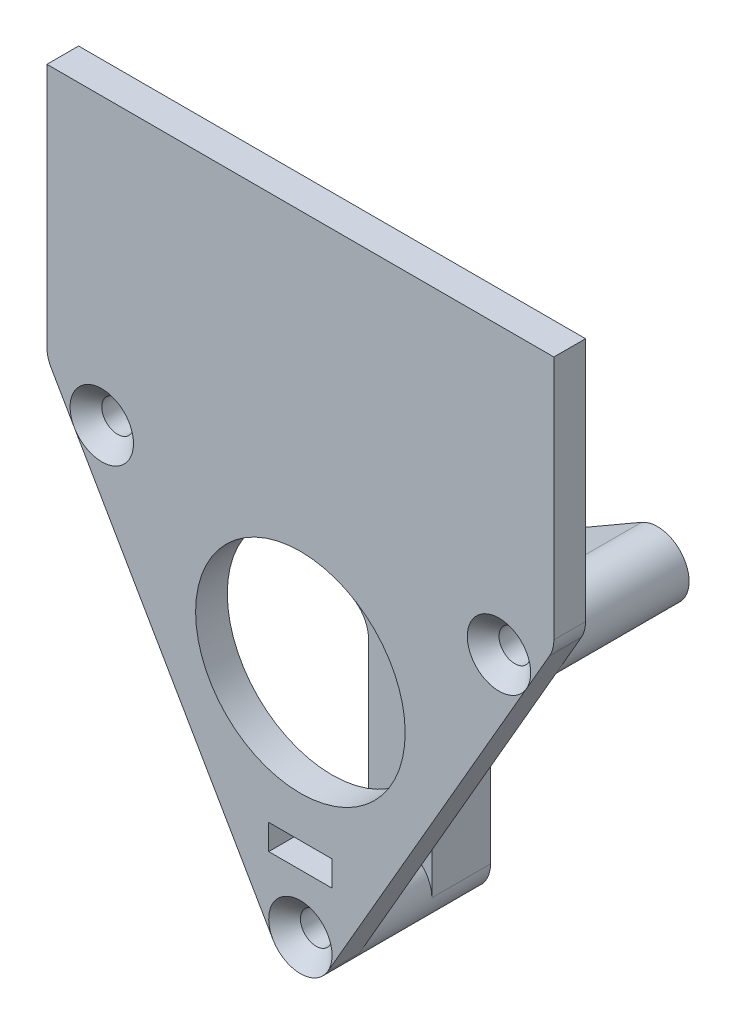
ISO-10303-21;
HEADER;
FILE_DESCRIPTION(('STEP AP214'),'2;1');
FILE_NAME('part.step','',(''),(''),'','','');
FILE_SCHEMA(('AUTOMOTIVE_DESIGN { 1 0 10303 214 1 1 1 1 }'));
ENDSEC;
DATA;
#1=APPLICATION_CONTEXT('core data for automotive mechanical design processes');
#2=APPLICATION_PROTOCOL_DEFINITION('international standard','automotive_design',2000,#1);
#3=PRODUCT_CONTEXT('',#1,'mechanical');
#4=PRODUCT('Part','Part','',(#3));
#5=PRODUCT_RELATED_PRODUCT_CATEGORY('part','',(#4));
#6=PRODUCT_DEFINITION_FORMATION('','',#4);
#7=PRODUCT_DEFINITION_CONTEXT('part definition',#1,'design');
#8=PRODUCT_DEFINITION('design','',#6,#7);
#9=PRODUCT_DEFINITION_SHAPE('','',#8);
#10=(LENGTH_UNIT() NAMED_UNIT(*) SI_UNIT(.MILLI.,.METRE.));
#11=(NAMED_UNIT(*) PLANE_ANGLE_UNIT() SI_UNIT($,.RADIAN.));
#12=(NAMED_UNIT(*) SI_UNIT($,.STERADIAN.) SOLID_ANGLE_UNIT());
#13=UNCERTAINTY_MEASURE_WITH_UNIT(LENGTH_MEASURE(1.E-05),#10,'distance_accuracy_value','');
#14=(GEOMETRIC_REPRESENTATION_CONTEXT(3) GLOBAL_UNCERTAINTY_ASSIGNED_CONTEXT((#13)) GLOBAL_UNIT_ASSIGNED_CONTEXT((#10,
#11,#12)) REPRESENTATION_CONTEXT('',''));
#15=CARTESIAN_POINT('',(0.,0.,0.));
#16=DIRECTION('',(0.,0.,1.));
#17=DIRECTION('',(1.,0.,0.));
#18=AXIS2_PLACEMENT_3D('',#15,#16,#17);
#19=CARTESIAN_POINT('',(-6.35,0.,50.8562346175287));
#20=DIRECTION('',(-1.,0.,0.));
#21=DIRECTION('',(0.,-1.,0.));
#22=AXIS2_PLACEMENT_3D('',#19,#20,#21);
#23=PLANE('',#22);
#24=DIRECTION('',(0.,-1.,0.));
#25=VECTOR('',#24,1.);
#26=CARTESIAN_POINT('',(-6.35,0.,-16.825));
#27=LINE('',#26,#25);
#28=CARTESIAN_POINT('',(-6.35,-7.33234841870833,-16.825));
#29=VERTEX_POINT('',#28);
#30=CARTESIAN_POINT('',(-6.35,-45.958787349666,-16.825));
#31=VERTEX_POINT('',#30);
#32=EDGE_CURVE('E257',#29,#31,#27,.T.);
#33=ORIENTED_EDGE('',*,*,#32,.F.);
#34=DIRECTION('',(0.,0.,-1.));
#35=VECTOR('',#34,1.);
#36=CARTESIAN_POINT('',(-6.35,-7.33234841870833,50.8562346175287));
#37=LINE('',#36,#35);
#38=CARTESIAN_POINT('',(-6.35,-7.33234841870833,-28.575));
#39=VERTEX_POINT('',#38);
#40=EDGE_CURVE('E406',#29,#39,#37,.T.);
#41=ORIENTED_EDGE('',*,*,#40,.T.);
#42=DIRECTION('',(0.,1.,0.));
#43=VECTOR('',#42,1.);
#44=CARTESIAN_POINT('',(-6.35,0.,-28.575));
#45=LINE('',#44,#43);
#46=CARTESIAN_POINT('',(-6.35,-45.958787349666,-28.575));
#47=VERTEX_POINT('',#46);
#48=EDGE_CURVE('E249',#47,#39,#45,.T.);
#49=ORIENTED_EDGE('',*,*,#48,.F.);
#50=DIRECTION('',(0.,0.,-1.));
#51=VECTOR('',#50,1.);
#52=CARTESIAN_POINT('',(-6.35,-45.958787349666,50.8562346175287));
#53=LINE('',#52,#51);
#54=EDGE_CURVE('E262',#31,#47,#53,.T.);
#55=ORIENTED_EDGE('',*,*,#54,.F.);
#56=EDGE_LOOP('',(#33,#41,#49,#55));
#57=FACE_BOUND('',#56,.T.);
#58=ADVANCED_FACE('F41',(#57),#23,.T.);
#59=CARTESIAN_POINT('',(-39.8014773719378,22.9793936748326,-28.575));
#60=DIRECTION('',(0.,0.,1.));
#61=DIRECTION('',(1.,0.,0.));
#62=AXIS2_PLACEMENT_3D('',#59,#60,#61);
#63=CYLINDRICAL_SURFACE('',#62,6.35);
#64=CARTESIAN_POINT('',(-39.8014773719378,22.9793936748326,-3.175));
#65=DIRECTION('',(0.,0.,-1.));
#66=DIRECTION('',(0.499999999999992,0.866025403784443,0.));
#67=AXIS2_PLACEMENT_3D('',#64,#65,#66);
#68=CIRCLE('',#67,6.35);
#69=CARTESIAN_POINT('',(-45.3007386859687,19.8043936748328,-3.175));
#70=VERTEX_POINT('',#69);
#71=EDGE_CURVE('E238',#70,#70,#68,.T.);
#72=ORIENTED_EDGE('',*,*,#71,.T.);
#73=EDGE_LOOP('',(#72));
#74=FACE_BOUND('',#73,.T.);
#75=DIRECTION('',(0.,0.,-1.));
#76=VECTOR('',#75,1.);
#77=CARTESIAN_POINT('',(-36.6264773719379,28.4786549888638,60.4851880986184));
#78=LINE('',#77,#76);
#79=CARTESIAN_POINT('',(-36.6264773719379,28.4786549888638,-16.825));
#80=VERTEX_POINT('',#79);
#81=CARTESIAN_POINT('',(-36.6264773719379,28.4786549888638,-28.575));
#82=VERTEX_POINT('',#81);
#83=EDGE_CURVE('E217',#80,#82,#78,.T.);
#84=ORIENTED_EDGE('',*,*,#83,.T.);
#85=CARTESIAN_POINT('',(-39.8014773719378,22.9793936748326,-28.575));
#86=DIRECTION('',(0.,0.,-1.));
#87=DIRECTION('',(0.499999999999992,0.866025403784443,0.));
#88=AXIS2_PLACEMENT_3D('',#85,#86,#87);
#89=CIRCLE('',#88,6.35);
#90=CARTESIAN_POINT('',(-42.9764773719378,17.4801323608014,-28.575));
#91=VERTEX_POINT('',#90);
#92=EDGE_CURVE('E229',#91,#82,#89,.T.);
#93=ORIENTED_EDGE('',*,*,#92,.F.);
#94=DIRECTION('',(0.,0.,-1.));
#95=VECTOR('',#94,1.);
#96=CARTESIAN_POINT('',(-42.9764773719378,17.4801323608014,60.4851880986184));
#97=LINE('',#96,#95);
#98=CARTESIAN_POINT('',(-42.9764773719378,17.4801323608014,-16.825));
#99=VERTEX_POINT('',#98);
#100=EDGE_CURVE('E232',#99,#91,#97,.T.);
#101=ORIENTED_EDGE('',*,*,#100,.F.);
#102=CARTESIAN_POINT('',(-39.8014773719378,22.9793936748326,-16.825));
#103=DIRECTION('',(0.,0.,-1.));
#104=DIRECTION('',(-1.,0.,0.));
#105=AXIS2_PLACEMENT_3D('',#102,#103,#104);
#106=CIRCLE('',#105,6.35);
#107=EDGE_CURVE('E231',#99,#80,#106,.F.);
#108=ORIENTED_EDGE('',*,*,#107,.T.);
#109=EDGE_LOOP('',(#84,#93,#101,#108));
#110=FACE_BOUND('',#109,.T.);
#111=ADVANCED_FACE('F227',(#74,#110),#63,.T.);
#112=CARTESIAN_POINT('',(0.,-45.958787349666,3.175));
#113=DIRECTION('',(0.,0.,-1.));
#114=DIRECTION('',(-1.,0.,0.));
#115=AXIS2_PLACEMENT_3D('',#112,#113,#114);
#116=CYLINDRICAL_SURFACE('',#115,6.35);
#117=CARTESIAN_POINT('',(0.,-45.958787349666,3.175));
#118=DIRECTION('',(0.,0.,-1.));
#119=DIRECTION('',(-1.,0.,0.));
#120=AXIS2_PLACEMENT_3D('',#117,#118,#119);
#121=CIRCLE('',#120,6.35);
#122=CARTESIAN_POINT('',(-5.49926131403119,-49.133787349666,3.175));
#123=VERTEX_POINT('',#122);
#124=CARTESIAN_POINT('',(5.49926131403118,-49.133787349666,3.175));
#125=VERTEX_POINT('',#124);
#126=EDGE_CURVE('E366',#123,#125,#121,.F.);
#127=ORIENTED_EDGE('',*,*,#126,.F.);
#128=DIRECTION('',(0.,0.,-1.));
#129=VECTOR('',#128,1.);
#130=CARTESIAN_POINT('',(-5.49926131403119,-49.133787349666,3.175));
#131=LINE('',#130,#129);
#132=CARTESIAN_POINT('',(-5.49926131403119,-49.133787349666,-3.175));
#133=VERTEX_POINT('',#132);
#134=EDGE_CURVE('E353',#133,#123,#131,.F.);
#135=ORIENTED_EDGE('',*,*,#134,.F.);
#136=CARTESIAN_POINT('',(0.,-45.958787349666,-3.175));
#137=DIRECTION('',(0.,0.,-1.));
#138=DIRECTION('',(-1.,0.,0.));
#139=AXIS2_PLACEMENT_3D('',#136,#137,#138);
#140=CIRCLE('',#139,6.35);
#141=CARTESIAN_POINT('',(5.49926131403119,-49.133787349666,-3.175));
#142=VERTEX_POINT('',#141);
#143=EDGE_CURVE('E275',#133,#142,#140,.T.);
#144=ORIENTED_EDGE('',*,*,#143,.T.);
#145=DIRECTION('',(0.,0.,-1.));
#146=VECTOR('',#145,1.);
#147=CARTESIAN_POINT('',(5.49926131403118,-49.133787349666,3.175));
#148=LINE('',#147,#146);
#149=EDGE_CURVE('E376',#125,#142,#148,.T.);
#150=ORIENTED_EDGE('',*,*,#149,.F.);
#151=EDGE_LOOP('',(#127,#135,#144,#150));
#152=FACE_BOUND('',#151,.T.);
#153=CARTESIAN_POINT('',(0.,-45.958787349666,-28.575));
#154=DIRECTION('',(0.,0.,-1.));
#155=DIRECTION('',(-1.,0.,0.));
#156=AXIS2_PLACEMENT_3D('',#153,#154,#155);
#157=CIRCLE('',#156,6.35);
#158=CARTESIAN_POINT('',(6.35,-45.958787349666,-28.575));
#159=VERTEX_POINT('',#158);
#160=EDGE_CURVE('E271',#159,#47,#157,.T.);
#161=ORIENTED_EDGE('',*,*,#160,.F.);
#162=DIRECTION('',(0.,0.,-1.));
#163=VECTOR('',#162,1.);
#164=CARTESIAN_POINT('',(6.35,-45.958787349666,50.8562346175287));
#165=LINE('',#164,#163);
#166=CARTESIAN_POINT('',(6.35,-45.958787349666,-16.825));
#167=VERTEX_POINT('',#166);
#168=EDGE_CURVE('E254',#167,#159,#165,.T.);
#169=ORIENTED_EDGE('',*,*,#168,.F.);
#170=CARTESIAN_POINT('',(0.,-45.958787349666,-16.825));
#171=DIRECTION('',(0.,0.,-1.));
#172=DIRECTION('',(-1.,0.,0.));
#173=AXIS2_PLACEMENT_3D('',#170,#171,#172);
#174=CIRCLE('',#173,6.35);
#175=EDGE_CURVE('E253',#167,#31,#174,.F.);
#176=ORIENTED_EDGE('',*,*,#175,.T.);
#177=ORIENTED_EDGE('',*,*,#54,.T.);
#178=EDGE_LOOP('',(#161,#169,#176,#177));
#179=FACE_BOUND('',#178,.T.);
#180=ADVANCED_FACE('F481',(#152,#179),#116,.T.);
#181=CARTESIAN_POINT('',(50.8,29.329393674833,3.175));
#182=DIRECTION('',(-0.866025403784439,0.5,0.));
#183=DIRECTION('',(-0.5,-0.866025403784439,0.));
#184=AXIS2_PLACEMENT_3D('',#181,#182,#183);
#185=PLANE('',#184);
#186=DIRECTION('',(0.5,0.866025403784439,0.));
#187=VECTOR('',#186,1.);
#188=CARTESIAN_POINT('',(50.8,29.329393674833,-3.175));
#189=LINE('',#188,#187);
#190=CARTESIAN_POINT('',(45.3007386859689,19.8043936748331,-3.175));
#191=VERTEX_POINT('',#190);
#192=EDGE_CURVE('E334',#142,#191,#189,.T.);
#193=ORIENTED_EDGE('',*,*,#192,.T.);
#194=CARTESIAN_POINT('',(49.9492613140312,27.8558710467706,-3.175));
#195=VERTEX_POINT('',#194);
#196=EDGE_CURVE('E315',#191,#195,#189,.T.);
#197=ORIENTED_EDGE('',*,*,#196,.T.);
#198=DIRECTION('',(0.,0.,-1.));
#199=VECTOR('',#198,1.);
#200=CARTESIAN_POINT('',(49.9492613140312,27.8558710467706,3.175));
#201=LINE('',#200,#199);
#202=CARTESIAN_POINT('',(49.9492613140312,27.8558710467706,3.175));
#203=VERTEX_POINT('',#202);
#204=EDGE_CURVE('E279',#195,#203,#201,.F.);
#205=ORIENTED_EDGE('',*,*,#204,.T.);
#206=DIRECTION('',(0.5,0.866025403784439,0.));
#207=VECTOR('',#206,1.);
#208=CARTESIAN_POINT('',(50.8,29.329393674833,3.175));
#209=LINE('',#208,#207);
#210=CARTESIAN_POINT('',(45.3007386859689,19.8043936748331,3.175));
#211=VERTEX_POINT('',#210);
#212=EDGE_CURVE('E322',#211,#203,#209,.T.);
#213=ORIENTED_EDGE('',*,*,#212,.F.);
#214=EDGE_CURVE('E318',#125,#211,#209,.T.);
#215=ORIENTED_EDGE('',*,*,#214,.F.);
#216=ORIENTED_EDGE('',*,*,#149,.T.);
#217=EDGE_LOOP('',(#193,#197,#205,#213,#215,#216));
#218=FACE_BOUND('',#217,.T.);
#219=ADVANCED_FACE('F545',(#218),#185,.F.);
#220=CARTESIAN_POINT('',(50.8,80.129393674833,3.175));
#221=DIRECTION('',(-1.,0.,0.));
#222=DIRECTION('',(0.,0.,1.));
#223=AXIS2_PLACEMENT_3D('',#220,#221,#222);
#224=PLANE('',#223);
#225=DIRECTION('',(0.,1.,0.));
#226=VECTOR('',#225,1.);
#227=CARTESIAN_POINT('',(50.8,80.129393674833,3.175));
#228=LINE('',#227,#226);
#229=CARTESIAN_POINT('',(50.8,31.0308710467706,3.175));
#230=VERTEX_POINT('',#229);
#231=CARTESIAN_POINT('',(50.8,80.129393674833,3.175));
#232=VERTEX_POINT('',#231);
#233=EDGE_CURVE('E321',#230,#232,#228,.T.);
#234=ORIENTED_EDGE('',*,*,#233,.F.);
#235=DIRECTION('',(0.,0.,-1.));
#236=VECTOR('',#235,1.);
#237=CARTESIAN_POINT('',(50.8,31.0308710467706,3.175));
#238=LINE('',#237,#236);
#239=CARTESIAN_POINT('',(50.8,31.0308710467706,-3.175));
#240=VERTEX_POINT('',#239);
#241=EDGE_CURVE('E373',#230,#240,#238,.T.);
#242=ORIENTED_EDGE('',*,*,#241,.T.);
#243=DIRECTION('',(0.,1.,0.));
#244=VECTOR('',#243,1.);
#245=CARTESIAN_POINT('',(50.8,80.129393674833,-3.175));
#246=LINE('',#245,#244);
#247=CARTESIAN_POINT('',(50.8,80.129393674833,-3.175));
#248=VERTEX_POINT('',#247);
#249=EDGE_CURVE('E337',#240,#248,#246,.T.);
#250=ORIENTED_EDGE('',*,*,#249,.T.);
#251=DIRECTION('',(0.,0.,-1.));
#252=VECTOR('',#251,1.);
#253=CARTESIAN_POINT('',(50.8,80.129393674833,3.175));
#254=LINE('',#253,#252);
#255=EDGE_CURVE('E350',#232,#248,#254,.T.);
#256=ORIENTED_EDGE('',*,*,#255,.F.);
#257=EDGE_LOOP('',(#234,#242,#250,#256));
#258=FACE_BOUND('',#257,.T.);
#259=ADVANCED_FACE('F541',(#258),#224,.F.);
#260=CARTESIAN_POINT('',(-50.8,80.129393674833,3.175));
#261=DIRECTION('',(0.,-1.,0.));
#262=DIRECTION('',(0.,0.,-1.));
#263=AXIS2_PLACEMENT_3D('',#260,#261,#262);
#264=PLANE('',#263);
#265=DIRECTION('',(-1.,0.,0.));
#266=VECTOR('',#265,1.);
#267=CARTESIAN_POINT('',(-50.8,80.129393674833,-3.175));
#268=LINE('',#267,#266);
#269=CARTESIAN_POINT('',(-50.8,80.129393674833,-3.175));
#270=VERTEX_POINT('',#269);
#271=EDGE_CURVE('E339',#248,#270,#268,.T.);
#272=ORIENTED_EDGE('',*,*,#271,.T.);
#273=DIRECTION('',(0.,0.,-1.));
#274=VECTOR('',#273,1.);
#275=CARTESIAN_POINT('',(-50.8,80.129393674833,3.175));
#276=LINE('',#275,#274);
#277=CARTESIAN_POINT('',(-50.8,80.129393674833,3.175));
#278=VERTEX_POINT('',#277);
#279=EDGE_CURVE('E333',#278,#270,#276,.T.);
#280=ORIENTED_EDGE('',*,*,#279,.F.);
#281=DIRECTION('',(-1.,0.,0.));
#282=VECTOR('',#281,1.);
#283=CARTESIAN_POINT('',(-50.8,80.129393674833,3.175));
#284=LINE('',#283,#282);
#285=EDGE_CURVE('E324',#232,#278,#284,.T.);
#286=ORIENTED_EDGE('',*,*,#285,.F.);
#287=ORIENTED_EDGE('',*,*,#255,.T.);
#288=EDGE_LOOP('',(#272,#280,#286,#287));
#289=FACE_BOUND('',#288,.T.);
#290=ADVANCED_FACE('F537',(#289),#264,.F.);
#291=CARTESIAN_POINT('',(-50.8,29.329393674833,3.175));
#292=DIRECTION('',(1.,0.,0.));
#293=DIRECTION('',(0.,0.,-1.));
#294=AXIS2_PLACEMENT_3D('',#291,#292,#293);
#295=PLANE('',#294);
#296=DIRECTION('',(0.,-1.,0.));
#297=VECTOR('',#296,1.);
#298=CARTESIAN_POINT('',(-50.8,29.329393674833,-3.175));
#299=LINE('',#298,#297);
#300=CARTESIAN_POINT('',(-50.8,31.0308710467706,-3.175));
#301=VERTEX_POINT('',#300);
#302=EDGE_CURVE('E341',#270,#301,#299,.T.);
#303=ORIENTED_EDGE('',*,*,#302,.T.);
#304=DIRECTION('',(0.,0.,-1.));
#305=VECTOR('',#304,1.);
#306=CARTESIAN_POINT('',(-50.8,31.0308710467706,3.175));
#307=LINE('',#306,#305);
#308=CARTESIAN_POINT('',(-50.8,31.0308710467706,3.175));
#309=VERTEX_POINT('',#308);
#310=EDGE_CURVE('E364',#301,#309,#307,.F.);
#311=ORIENTED_EDGE('',*,*,#310,.T.);
#312=DIRECTION('',(0.,-1.,0.));
#313=VECTOR('',#312,1.);
#314=CARTESIAN_POINT('',(-50.8,29.329393674833,3.175));
#315=LINE('',#314,#313);
#316=EDGE_CURVE('E326',#278,#309,#315,.T.);
#317=ORIENTED_EDGE('',*,*,#316,.F.);
#318=ORIENTED_EDGE('',*,*,#279,.T.);
#319=EDGE_LOOP('',(#303,#311,#317,#318));
#320=FACE_BOUND('',#319,.T.);
#321=ADVANCED_FACE('F533',(#320),#295,.F.);
#322=CARTESIAN_POINT('',(0.,-58.658787349666,3.175));
#323=DIRECTION('',(0.866025403784439,0.5,0.));
#324=DIRECTION('',(-0.5,0.866025403784439,0.));
#325=AXIS2_PLACEMENT_3D('',#322,#323,#324);
#326=PLANE('',#325);
#327=DIRECTION('',(0.5,-0.866025403784439,0.));
#328=VECTOR('',#327,1.);
#329=CARTESIAN_POINT('',(0.,-58.658787349666,3.175));
#330=LINE('',#329,#328);
#331=CARTESIAN_POINT('',(-49.9492613140312,27.8558710467706,3.175));
#332=VERTEX_POINT('',#331);
#333=CARTESIAN_POINT('',(-45.3007386859687,19.8043936748328,3.175));
#334=VERTEX_POINT('',#333);
#335=EDGE_CURVE('E330',#332,#334,#330,.T.);
#336=ORIENTED_EDGE('',*,*,#335,.F.);
#337=DIRECTION('',(0.,0.,-1.));
#338=VECTOR('',#337,1.);
#339=CARTESIAN_POINT('',(-49.9492613140312,27.8558710467706,3.175));
#340=LINE('',#339,#338);
#341=CARTESIAN_POINT('',(-49.9492613140312,27.8558710467706,-3.175));
#342=VERTEX_POINT('',#341);
#343=EDGE_CURVE('E356',#332,#342,#340,.T.);
#344=ORIENTED_EDGE('',*,*,#343,.T.);
#345=DIRECTION('',(0.5,-0.866025403784439,0.));
#346=VECTOR('',#345,1.);
#347=CARTESIAN_POINT('',(0.,-58.658787349666,-3.175));
#348=LINE('',#347,#346);
#349=EDGE_CURVE('E345',#342,#70,#348,.T.);
#350=ORIENTED_EDGE('',*,*,#349,.T.);
#351=EDGE_CURVE('E344',#70,#133,#348,.T.);
#352=ORIENTED_EDGE('',*,*,#351,.T.);
#353=ORIENTED_EDGE('',*,*,#134,.T.);
#354=EDGE_CURVE('E329',#334,#123,#330,.T.);
#355=ORIENTED_EDGE('',*,*,#354,.F.);
#356=EDGE_LOOP('',(#336,#344,#350,#352,#353,#355));
#357=FACE_BOUND('',#356,.T.);
#358=ADVANCED_FACE('F526',(#357),#326,.F.);
#359=CARTESIAN_POINT('',(0.,0.,3.175));
#360=DIRECTION('',(0.,0.,-1.));
#361=DIRECTION('',(-1.,0.,0.));
#362=AXIS2_PLACEMENT_3D('',#359,#360,#361);
#363=PLANE('',#362);
#364=DIRECTION('',(-1.,0.,0.));
#365=VECTOR('',#364,1.);
#366=CARTESIAN_POINT('',(-6.35,-29.21,3.175));
#367=LINE('',#366,#365);
#368=CARTESIAN_POINT('',(6.35,-29.21,3.175));
#369=VERTEX_POINT('',#368);
#370=CARTESIAN_POINT('',(-6.35,-29.21,3.175));
#371=VERTEX_POINT('',#370);
#372=EDGE_CURVE('E295',#369,#371,#367,.T.);
#373=ORIENTED_EDGE('',*,*,#372,.F.);
#374=DIRECTION('',(0.,1.,0.));
#375=VECTOR('',#374,1.);
#376=CARTESIAN_POINT('',(6.35,-34.29,3.175));
#377=LINE('',#376,#375);
#378=CARTESIAN_POINT('',(6.35,-34.29,3.175));
#379=VERTEX_POINT('',#378);
#380=EDGE_CURVE('E274',#379,#369,#377,.T.);
#381=ORIENTED_EDGE('',*,*,#380,.F.);
#382=DIRECTION('',(1.,0.,0.));
#383=VECTOR('',#382,1.);
#384=CARTESIAN_POINT('',(-6.35,-34.29,3.175));
#385=LINE('',#384,#383);
#386=CARTESIAN_POINT('',(-6.35,-34.29,3.175));
#387=VERTEX_POINT('',#386);
#388=EDGE_CURVE('E284',#387,#379,#385,.T.);
#389=ORIENTED_EDGE('',*,*,#388,.F.);
#390=DIRECTION('',(0.,-1.,0.));
#391=VECTOR('',#390,1.);
#392=CARTESIAN_POINT('',(-6.35,-34.29,3.175));
#393=LINE('',#392,#391);
#394=EDGE_CURVE('E298',#371,#387,#393,.T.);
#395=ORIENTED_EDGE('',*,*,#394,.F.);
#396=EDGE_LOOP('',(#373,#381,#389,#395));
#397=FACE_BOUND('',#396,.T.);
#398=CARTESIAN_POINT('',(0.,0.,3.175));
#399=DIRECTION('',(0.,0.,1.));
#400=DIRECTION('',(1.,0.,0.));
#401=AXIS2_PLACEMENT_3D('',#398,#399,#400);
#402=CIRCLE('',#401,21.);
#403=CARTESIAN_POINT('',(21.,0.,3.175));
#404=VERTEX_POINT('',#403);
#405=EDGE_CURVE('E305',#404,#404,#402,.T.);
#406=ORIENTED_EDGE('',*,*,#405,.F.);
#407=EDGE_LOOP('',(#406));
#408=FACE_BOUND('',#407,.T.);
#409=ORIENTED_EDGE('',*,*,#335,.T.);
#410=CARTESIAN_POINT('',(-39.8014773719378,22.9793936748326,3.175));
#411=DIRECTION('',(0.,0.,-1.));
#412=DIRECTION('',(-1.,0.,0.));
#413=AXIS2_PLACEMENT_3D('',#410,#411,#412);
#414=CIRCLE('',#413,6.34999999999998);
#415=EDGE_CURVE('E394',#334,#334,#414,.T.);
#416=ORIENTED_EDGE('',*,*,#415,.T.);
#417=ORIENTED_EDGE('',*,*,#354,.T.);
#418=CARTESIAN_POINT('',(0.,-45.958787349666,3.175));
#419=DIRECTION('',(0.,0.,-1.));
#420=DIRECTION('',(-1.,0.,0.));
#421=AXIS2_PLACEMENT_3D('',#418,#419,#420);
#422=CIRCLE('',#421,6.35000000000002);
#423=EDGE_CURVE('E383',#123,#125,#422,.T.);
#424=ORIENTED_EDGE('',*,*,#423,.T.);
#425=ORIENTED_EDGE('',*,*,#214,.T.);
#426=CARTESIAN_POINT('',(39.8014773719375,22.9793936748332,3.175));
#427=DIRECTION('',(0.,0.,-1.));
#428=DIRECTION('',(-1.,0.,0.));
#429=AXIS2_PLACEMENT_3D('',#426,#427,#428);
#430=CIRCLE('',#429,6.35000000000005);
#431=EDGE_CURVE('E388',#211,#211,#430,.T.);
#432=ORIENTED_EDGE('',*,*,#431,.T.);
#433=ORIENTED_EDGE('',*,*,#212,.T.);
#434=CARTESIAN_POINT('',(44.45,31.0308710467706,3.175));
#435=DIRECTION('',(0.,0.,-1.));
#436=DIRECTION('',(-1.,0.,0.));
#437=AXIS2_PLACEMENT_3D('',#434,#435,#436);
#438=CIRCLE('',#437,6.35);
#439=EDGE_CURVE('E369',#203,#230,#438,.F.);
#440=ORIENTED_EDGE('',*,*,#439,.T.);
#441=ORIENTED_EDGE('',*,*,#233,.T.);
#442=ORIENTED_EDGE('',*,*,#285,.T.);
#443=ORIENTED_EDGE('',*,*,#316,.T.);
#444=CARTESIAN_POINT('',(-44.45,31.0308710467706,3.175));
#445=DIRECTION('',(0.,0.,-1.));
#446=DIRECTION('',(-1.,0.,0.));
#447=AXIS2_PLACEMENT_3D('',#444,#445,#446);
#448=CIRCLE('',#447,6.35);
#449=EDGE_CURVE('E371',#309,#332,#448,.F.);
#450=ORIENTED_EDGE('',*,*,#449,.T.);
#451=EDGE_LOOP('',(#409,#416,#417,#424,#425,#432,#433,#440,#441,#442,#443,#450));
#452=FACE_BOUND('',#451,.T.);
#453=ADVANCED_FACE('F523',(#397,#408,#452),#363,.F.);
#454=CARTESIAN_POINT('',(0.,0.,-3.175));
#455=DIRECTION('',(0.,0.,-1.));
#456=DIRECTION('',(-1.,0.,0.));
#457=AXIS2_PLACEMENT_3D('',#454,#455,#456);
#458=PLANE('',#457);
#459=ORIENTED_EDGE('',*,*,#351,.F.);
#460=ORIENTED_EDGE('',*,*,#71,.F.);
#461=ORIENTED_EDGE('',*,*,#349,.F.);
#462=CARTESIAN_POINT('',(-44.45,31.0308710467706,-3.175));
#463=DIRECTION('',(0.,0.,-1.));
#464=DIRECTION('',(-1.,0.,0.));
#465=AXIS2_PLACEMENT_3D('',#462,#463,#464);
#466=CIRCLE('',#465,6.35);
#467=EDGE_CURVE('E362',#342,#301,#466,.T.);
#468=ORIENTED_EDGE('',*,*,#467,.T.);
#469=ORIENTED_EDGE('',*,*,#302,.F.);
#470=ORIENTED_EDGE('',*,*,#271,.F.);
#471=ORIENTED_EDGE('',*,*,#249,.F.);
#472=CARTESIAN_POINT('',(44.45,31.0308710467706,-3.175));
#473=DIRECTION('',(0.,0.,-1.));
#474=DIRECTION('',(-1.,0.,0.));
#475=AXIS2_PLACEMENT_3D('',#472,#473,#474);
#476=CIRCLE('',#475,6.35);
#477=EDGE_CURVE('E359',#240,#195,#476,.T.);
#478=ORIENTED_EDGE('',*,*,#477,.T.);
#479=ORIENTED_EDGE('',*,*,#196,.F.);
#480=CARTESIAN_POINT('',(39.8014773719375,22.9793936748332,-3.175));
#481=DIRECTION('',(0.,0.,-1.));
#482=DIRECTION('',(0.500000000000004,-0.866025403784436,0.));
#483=AXIS2_PLACEMENT_3D('',#480,#481,#482);
#484=CIRCLE('',#483,6.35);
#485=EDGE_CURVE('E237',#191,#191,#484,.T.);
#486=ORIENTED_EDGE('',*,*,#485,.F.);
#487=ORIENTED_EDGE('',*,*,#192,.F.);
#488=ORIENTED_EDGE('',*,*,#143,.F.);
#489=EDGE_LOOP('',(#459,#460,#461,#468,#469,#470,#471,#478,#479,#486,#487,#488));
#490=FACE_BOUND('',#489,.T.);
#491=DIRECTION('',(0.,1.,0.));
#492=VECTOR('',#491,1.);
#493=CARTESIAN_POINT('',(6.35,-34.29,-3.175));
#494=LINE('',#493,#492);
#495=CARTESIAN_POINT('',(6.35,-34.29,-3.175));
#496=VERTEX_POINT('',#495);
#497=CARTESIAN_POINT('',(6.35,-29.21,-3.175));
#498=VERTEX_POINT('',#497);
#499=EDGE_CURVE('E280',#496,#498,#494,.T.);
#500=ORIENTED_EDGE('',*,*,#499,.T.);
#501=DIRECTION('',(-1.,0.,0.));
#502=VECTOR('',#501,1.);
#503=CARTESIAN_POINT('',(-6.35,-29.21,-3.175));
#504=LINE('',#503,#502);
#505=CARTESIAN_POINT('',(-6.35,-29.21,-3.175));
#506=VERTEX_POINT('',#505);
#507=EDGE_CURVE('E283',#498,#506,#504,.T.);
#508=ORIENTED_EDGE('',*,*,#507,.T.);
#509=DIRECTION('',(0.,-1.,0.));
#510=VECTOR('',#509,1.);
#511=CARTESIAN_POINT('',(-6.35,-34.29,-3.175));
#512=LINE('',#511,#510);
#513=CARTESIAN_POINT('',(-6.35,-34.29,-3.175));
#514=VERTEX_POINT('',#513);
#515=EDGE_CURVE('E287',#506,#514,#512,.T.);
#516=ORIENTED_EDGE('',*,*,#515,.T.);
#517=DIRECTION('',(1.,0.,0.));
#518=VECTOR('',#517,1.);
#519=CARTESIAN_POINT('',(-6.35,-34.29,-3.175));
#520=LINE('',#519,#518);
#521=EDGE_CURVE('E290',#514,#496,#520,.T.);
#522=ORIENTED_EDGE('',*,*,#521,.T.);
#523=EDGE_LOOP('',(#500,#508,#516,#522));
#524=FACE_BOUND('',#523,.T.);
#525=CARTESIAN_POINT('',(0.,0.,-3.175));
#526=DIRECTION('',(0.,0.,1.));
#527=DIRECTION('',(1.,0.,0.));
#528=AXIS2_PLACEMENT_3D('',#525,#526,#527);
#529=CIRCLE('',#528,21.);
#530=CARTESIAN_POINT('',(21.,0.,-3.175));
#531=VERTEX_POINT('',#530);
#532=EDGE_CURVE('E312',#531,#531,#529,.T.);
#533=ORIENTED_EDGE('',*,*,#532,.T.);
#534=EDGE_LOOP('',(#533));
#535=FACE_BOUND('',#534,.T.);
#536=ADVANCED_FACE('F521',(#490,#524,#535),#458,.T.);
#537=CARTESIAN_POINT('',(0.,0.,-3.175));
#538=DIRECTION('',(0.,0.,1.));
#539=DIRECTION('',(1.,0.,0.));
#540=AXIS2_PLACEMENT_3D('',#537,#538,#539);
#541=CYLINDRICAL_SURFACE('',#540,21.);
#542=ORIENTED_EDGE('',*,*,#532,.F.);
#543=EDGE_LOOP('',(#542));
#544=FACE_BOUND('',#543,.T.);
#545=ORIENTED_EDGE('',*,*,#405,.T.);
#546=EDGE_LOOP('',(#545));
#547=FACE_BOUND('',#546,.T.);
#548=ADVANCED_FACE('F517',(#544,#547),#541,.F.);
#549=CARTESIAN_POINT('',(-44.45,31.0308710467706,3.175));
#550=DIRECTION('',(0.,0.,-1.));
#551=DIRECTION('',(-1.,0.,0.));
#552=AXIS2_PLACEMENT_3D('',#549,#550,#551);
#553=CYLINDRICAL_SURFACE('',#552,6.35);
#554=ORIENTED_EDGE('',*,*,#449,.F.);
#555=ORIENTED_EDGE('',*,*,#310,.F.);
#556=ORIENTED_EDGE('',*,*,#467,.F.);
#557=ORIENTED_EDGE('',*,*,#343,.F.);
#558=EDGE_LOOP('',(#554,#555,#556,#557));
#559=FACE_BOUND('',#558,.T.);
#560=ADVANCED_FACE('F520',(#559),#553,.T.);
#561=CARTESIAN_POINT('',(44.45,31.0308710467706,3.175));
#562=DIRECTION('',(0.,0.,-1.));
#563=DIRECTION('',(-1.,0.,0.));
#564=AXIS2_PLACEMENT_3D('',#561,#562,#563);
#565=CYLINDRICAL_SURFACE('',#564,6.35);
#566=ORIENTED_EDGE('',*,*,#439,.F.);
#567=ORIENTED_EDGE('',*,*,#204,.F.);
#568=ORIENTED_EDGE('',*,*,#477,.F.);
#569=ORIENTED_EDGE('',*,*,#241,.F.);
#570=EDGE_LOOP('',(#566,#567,#568,#569));
#571=FACE_BOUND('',#570,.T.);
#572=ADVANCED_FACE('F515',(#571),#565,.T.);
#573=CARTESIAN_POINT('',(6.35,-34.29,-3.175));
#574=DIRECTION('',(1.,0.,0.));
#575=DIRECTION('',(0.,0.,-1.));
#576=AXIS2_PLACEMENT_3D('',#573,#574,#575);
#577=PLANE('',#576);
#578=ORIENTED_EDGE('',*,*,#380,.T.);
#579=DIRECTION('',(0.,0.,1.));
#580=VECTOR('',#579,1.);
#581=CARTESIAN_POINT('',(6.35,-29.21,-3.175));
#582=LINE('',#581,#580);
#583=EDGE_CURVE('E293',#498,#369,#582,.T.);
#584=ORIENTED_EDGE('',*,*,#583,.F.);
#585=ORIENTED_EDGE('',*,*,#499,.F.);
#586=DIRECTION('',(0.,0.,1.));
#587=VECTOR('',#586,1.);
#588=CARTESIAN_POINT('',(6.35,-34.29,-3.175));
#589=LINE('',#588,#587);
#590=EDGE_CURVE('E303',#496,#379,#589,.T.);
#591=ORIENTED_EDGE('',*,*,#590,.T.);
#592=EDGE_LOOP('',(#578,#584,#585,#591));
#593=FACE_BOUND('',#592,.T.);
#594=ADVANCED_FACE('F505',(#593),#577,.F.);
#595=CARTESIAN_POINT('',(-6.35,-34.29,-3.175));
#596=DIRECTION('',(0.,-1.,0.));
#597=DIRECTION('',(0.,0.,-1.));
#598=AXIS2_PLACEMENT_3D('',#595,#596,#597);
#599=PLANE('',#598);
#600=ORIENTED_EDGE('',*,*,#388,.T.);
#601=ORIENTED_EDGE('',*,*,#590,.F.);
#602=ORIENTED_EDGE('',*,*,#521,.F.);
#603=DIRECTION('',(0.,0.,1.));
#604=VECTOR('',#603,1.);
#605=CARTESIAN_POINT('',(-6.35,-34.29,-3.175));
#606=LINE('',#605,#604);
#607=EDGE_CURVE('E306',#514,#387,#606,.T.);
#608=ORIENTED_EDGE('',*,*,#607,.T.);
#609=EDGE_LOOP('',(#600,#601,#602,#608));
#610=FACE_BOUND('',#609,.T.);
#611=ADVANCED_FACE('F501',(#610),#599,.F.);
#612=CARTESIAN_POINT('',(-6.35,-34.29,-3.175));
#613=DIRECTION('',(-1.,0.,0.));
#614=DIRECTION('',(0.,0.,1.));
#615=AXIS2_PLACEMENT_3D('',#612,#613,#614);
#616=PLANE('',#615);
#617=ORIENTED_EDGE('',*,*,#394,.T.);
#618=ORIENTED_EDGE('',*,*,#607,.F.);
#619=ORIENTED_EDGE('',*,*,#515,.F.);
#620=DIRECTION('',(0.,0.,1.));
#621=VECTOR('',#620,1.);
#622=CARTESIAN_POINT('',(-6.35,-29.21,-3.175));
#623=LINE('',#622,#621);
#624=EDGE_CURVE('E308',#506,#371,#623,.T.);
#625=ORIENTED_EDGE('',*,*,#624,.T.);
#626=EDGE_LOOP('',(#617,#618,#619,#625));
#627=FACE_BOUND('',#626,.T.);
#628=ADVANCED_FACE('F504',(#627),#616,.F.);
#629=CARTESIAN_POINT('',(-6.35,-29.21,-3.175));
#630=DIRECTION('',(0.,1.,0.));
#631=DIRECTION('',(0.,0.,1.));
#632=AXIS2_PLACEMENT_3D('',#629,#630,#631);
#633=PLANE('',#632);
#634=ORIENTED_EDGE('',*,*,#372,.T.);
#635=ORIENTED_EDGE('',*,*,#624,.F.);
#636=ORIENTED_EDGE('',*,*,#507,.F.);
#637=ORIENTED_EDGE('',*,*,#583,.T.);
#638=EDGE_LOOP('',(#634,#635,#636,#637));
#639=FACE_BOUND('',#638,.T.);
#640=ADVANCED_FACE('F499',(#639),#633,.F.);
#641=CARTESIAN_POINT('',(0.,-45.958787349666,-28.575));
#642=DIRECTION('',(0.,0.,-1.));
#643=DIRECTION('',(-1.,0.,0.));
#644=AXIS2_PLACEMENT_3D('',#641,#642,#643);
#645=PLANE('',#644);
#646=CARTESIAN_POINT('',(0.,0.,-28.575));
#647=DIRECTION('',(0.,0.,-1.));
#648=DIRECTION('',(-1.,0.,0.));
#649=AXIS2_PLACEMENT_3D('',#646,#647,#648);
#650=CIRCLE('',#649,3.);
#651=CARTESIAN_POINT('',(-3.,0.,-28.575));
#652=VERTEX_POINT('',#651);
#653=EDGE_CURVE('E670',#652,#652,#650,.T.);
#654=ORIENTED_EDGE('',*,*,#653,.F.);
#655=EDGE_LOOP('',(#654));
#656=FACE_BOUND('',#655,.T.);
#657=DIRECTION('',(-0.866025403784436,-0.500000000000004,0.));
#658=VECTOR('',#657,1.);
#659=CARTESIAN_POINT('',(3.17500000000003,-5.49926131403118,-28.575));
#660=LINE('',#659,#658);
#661=CARTESIAN_POINT('',(42.9764773719375,17.480132360802,-28.575));
#662=VERTEX_POINT('',#661);
#663=CARTESIAN_POINT('',(9.52499999999998,-1.83308710467704,-28.575));
#664=VERTEX_POINT('',#663);
#665=EDGE_CURVE('E430',#662,#664,#660,.T.);
#666=ORIENTED_EDGE('',*,*,#665,.T.);
#667=CARTESIAN_POINT('',(12.7,-7.33234841870821,-28.575));
#668=DIRECTION('',(0.,0.,-1.));
#669=DIRECTION('',(-1.,0.,0.));
#670=AXIS2_PLACEMENT_3D('',#667,#668,#669);
#671=CIRCLE('',#670,6.35);
#672=CARTESIAN_POINT('',(6.35,-7.33234841870821,-28.575));
#673=VERTEX_POINT('',#672);
#674=EDGE_CURVE('E412',#664,#673,#671,.F.);
#675=ORIENTED_EDGE('',*,*,#674,.T.);
#676=DIRECTION('',(0.,1.,0.));
#677=VECTOR('',#676,1.);
#678=CARTESIAN_POINT('',(6.35,0.,-28.575));
#679=LINE('',#678,#677);
#680=EDGE_CURVE('E259',#159,#673,#679,.T.);
#681=ORIENTED_EDGE('',*,*,#680,.F.);
#682=ORIENTED_EDGE('',*,*,#160,.T.);
#683=ORIENTED_EDGE('',*,*,#48,.T.);
#684=CARTESIAN_POINT('',(-12.7,-7.33234841870833,-28.575));
#685=DIRECTION('',(0.,0.,-1.));
#686=DIRECTION('',(-1.,0.,0.));
#687=AXIS2_PLACEMENT_3D('',#684,#685,#686);
#688=CIRCLE('',#687,6.35);
#689=CARTESIAN_POINT('',(-9.52500000000005,-1.83308710467711,-28.575));
#690=VERTEX_POINT('',#689);
#691=EDGE_CURVE('E50',#39,#690,#688,.F.);
#692=ORIENTED_EDGE('',*,*,#691,.T.);
#693=DIRECTION('',(0.866025403784443,-0.499999999999992,0.));
#694=VECTOR('',#693,1.);
#695=CARTESIAN_POINT('',(-3.17499999999995,-5.49926131403122,-28.575));
#696=LINE('',#695,#694);
#697=EDGE_CURVE('E223',#91,#690,#696,.T.);
#698=ORIENTED_EDGE('',*,*,#697,.F.);
#699=ORIENTED_EDGE('',*,*,#92,.T.);
#700=DIRECTION('',(0.866025403784443,-0.499999999999992,0.));
#701=VECTOR('',#700,1.);
#702=CARTESIAN_POINT('',(3.17499999999995,5.49926131403122,-28.575));
#703=LINE('',#702,#701);
#704=CARTESIAN_POINT('',(-3.17500000000005,9.16543552338526,-28.575));
#705=VERTEX_POINT('',#704);
#706=EDGE_CURVE('E213',#82,#705,#703,.T.);
#707=ORIENTED_EDGE('',*,*,#706,.T.);
#708=CARTESIAN_POINT('',(-1.0321604682062E-13,14.6646968374165,-28.575));
#709=DIRECTION('',(0.,0.,-1.));
#710=DIRECTION('',(-1.,0.,0.));
#711=AXIS2_PLACEMENT_3D('',#708,#709,#710);
#712=CIRCLE('',#711,6.35);
#713=CARTESIAN_POINT('',(3.17499999999992,9.16543552338531,-28.575));
#714=VERTEX_POINT('',#713);
#715=EDGE_CURVE('E416',#705,#714,#712,.F.);
#716=ORIENTED_EDGE('',*,*,#715,.T.);
#717=DIRECTION('',(-0.866025403784436,-0.500000000000004,0.));
#718=VECTOR('',#717,1.);
#719=CARTESIAN_POINT('',(-3.17500000000003,5.49926131403118,-28.575));
#720=LINE('',#719,#718);
#721=CARTESIAN_POINT('',(36.6264773719375,28.4786549888643,-28.575));
#722=VERTEX_POINT('',#721);
#723=EDGE_CURVE('E419',#722,#714,#720,.T.);
#724=ORIENTED_EDGE('',*,*,#723,.F.);
#725=CARTESIAN_POINT('',(39.8014773719375,22.9793936748332,-28.575));
#726=DIRECTION('',(0.,0.,-1.));
#727=DIRECTION('',(0.500000000000004,-0.866025403784436,0.));
#728=AXIS2_PLACEMENT_3D('',#725,#726,#727);
#729=CIRCLE('',#728,6.35);
#730=EDGE_CURVE('E240',#722,#662,#729,.T.);
#731=ORIENTED_EDGE('',*,*,#730,.T.);
#732=EDGE_LOOP('',(#666,#675,#681,#682,#683,#692,#698,#699,#707,#716,#724,#731));
#733=FACE_BOUND('',#732,.T.);
#734=ADVANCED_FACE('F235',(#656,#733),#645,.T.);
#735=CARTESIAN_POINT('',(0.,-45.958787349666,-22.225));
#736=DIRECTION('',(0.,0.,1.));
#737=DIRECTION('',(1.,0.,0.));
#738=AXIS2_PLACEMENT_3D('',#735,#736,#737);
#739=CYLINDRICAL_SURFACE('',#738,3.175);
#740=CARTESIAN_POINT('',(0.,-45.958787349666,0.));
#741=DIRECTION('',(0.,0.,-1.));
#742=DIRECTION('',(-1.,0.,0.));
#743=AXIS2_PLACEMENT_3D('',#740,#741,#742);
#744=CIRCLE('',#743,3.175);
#745=CARTESIAN_POINT('',(-3.175,-45.958787349666,0.));
#746=VERTEX_POINT('',#745);
#747=EDGE_CURVE('E278',#746,#746,#744,.F.);
#748=ORIENTED_EDGE('',*,*,#747,.T.);
#749=EDGE_LOOP('',(#748));
#750=FACE_BOUND('',#749,.T.);
#751=CARTESIAN_POINT('',(0.,-45.958787349666,-22.225));
#752=DIRECTION('',(0.,0.,1.));
#753=DIRECTION('',(1.,0.,0.));
#754=AXIS2_PLACEMENT_3D('',#751,#752,#753);
#755=CIRCLE('',#754,3.175);
#756=CARTESIAN_POINT('',(3.175,-45.958787349666,-22.225));
#757=VERTEX_POINT('',#756);
#758=EDGE_CURVE('E268',#757,#757,#755,.T.);
#759=ORIENTED_EDGE('',*,*,#758,.F.);
#760=EDGE_LOOP('',(#759));
#761=FACE_BOUND('',#760,.T.);
#762=ADVANCED_FACE('F492',(#750,#761),#739,.F.);
#763=CARTESIAN_POINT('',(0.,-45.958787349666,-22.225));
#764=DIRECTION('',(0.,0.,1.));
#765=DIRECTION('',(1.,0.,0.));
#766=AXIS2_PLACEMENT_3D('',#763,#764,#765);
#767=PLANE('',#766);
#768=ORIENTED_EDGE('',*,*,#758,.T.);
#769=EDGE_LOOP('',(#768));
#770=FACE_BOUND('',#769,.T.);
#771=ADVANCED_FACE('F488',(#770),#767,.T.);
#772=CARTESIAN_POINT('',(0.,-45.958787349666,0.));
#773=DIRECTION('',(0.,0.,1.));
#774=DIRECTION('',(1.,0.,0.));
#775=AXIS2_PLACEMENT_3D('',#772,#773,#774);
#776=CONICAL_SURFACE('',#775,3.175,0.785398163397451);
#777=ORIENTED_EDGE('',*,*,#423,.F.);
#778=ORIENTED_EDGE('',*,*,#126,.T.);
#779=EDGE_LOOP('',(#777,#778));
#780=FACE_BOUND('',#779,.T.);
#781=ORIENTED_EDGE('',*,*,#747,.F.);
#782=EDGE_LOOP('',(#781));
#783=FACE_BOUND('',#782,.T.);
#784=ADVANCED_FACE('F491',(#780,#783),#776,.F.);
#785=CARTESIAN_POINT('',(6.35,0.,50.8562346175287));
#786=DIRECTION('',(-1.,0.,0.));
#787=DIRECTION('',(0.,-1.,0.));
#788=AXIS2_PLACEMENT_3D('',#785,#786,#787);
#789=PLANE('',#788);
#790=ORIENTED_EDGE('',*,*,#680,.T.);
#791=DIRECTION('',(0.,0.,1.));
#792=VECTOR('',#791,1.);
#793=CARTESIAN_POINT('',(6.35,-7.33234841870821,50.8562346175287));
#794=LINE('',#793,#792);
#795=CARTESIAN_POINT('',(6.35,-7.33234841870821,-16.825));
#796=VERTEX_POINT('',#795);
#797=EDGE_CURVE('E397',#673,#796,#794,.T.);
#798=ORIENTED_EDGE('',*,*,#797,.T.);
#799=DIRECTION('',(0.,-1.,0.));
#800=VECTOR('',#799,1.);
#801=CARTESIAN_POINT('',(6.35,0.,-16.825));
#802=LINE('',#801,#800);
#803=EDGE_CURVE('E251',#796,#167,#802,.T.);
#804=ORIENTED_EDGE('',*,*,#803,.T.);
#805=ORIENTED_EDGE('',*,*,#168,.T.);
#806=EDGE_LOOP('',(#790,#798,#804,#805));
#807=FACE_BOUND('',#806,.T.);
#808=ADVANCED_FACE('F486',(#807),#789,.F.);
#809=CARTESIAN_POINT('',(0.,0.,-16.825));
#810=DIRECTION('',(0.,0.,-1.));
#811=DIRECTION('',(-1.,0.,0.));
#812=AXIS2_PLACEMENT_3D('',#809,#810,#811);
#813=PLANE('',#812);
#814=CARTESIAN_POINT('',(0.,0.,-16.825));
#815=DIRECTION('',(0.,0.,-1.));
#816=DIRECTION('',(-1.,0.,0.));
#817=AXIS2_PLACEMENT_3D('',#814,#815,#816);
#818=CIRCLE('',#817,3.);
#819=CARTESIAN_POINT('',(-3.,0.,-16.825));
#820=VERTEX_POINT('',#819);
#821=EDGE_CURVE('E45',#820,#820,#818,.T.);
#822=ORIENTED_EDGE('',*,*,#821,.T.);
#823=EDGE_LOOP('',(#822));
#824=FACE_BOUND('',#823,.T.);
#825=ORIENTED_EDGE('',*,*,#803,.F.);
#826=CARTESIAN_POINT('',(12.7,-7.33234841870821,-16.825));
#827=DIRECTION('',(0.,0.,-1.));
#828=DIRECTION('',(-1.,0.,0.));
#829=AXIS2_PLACEMENT_3D('',#826,#827,#828);
#830=CIRCLE('',#829,6.35);
#831=CARTESIAN_POINT('',(9.52499999999998,-1.83308710467704,-16.825));
#832=VERTEX_POINT('',#831);
#833=EDGE_CURVE('E410',#796,#832,#830,.T.);
#834=ORIENTED_EDGE('',*,*,#833,.T.);
#835=DIRECTION('',(0.866025403784436,0.500000000000004,0.));
#836=VECTOR('',#835,1.);
#837=CARTESIAN_POINT('',(3.17500000000003,-5.49926131403118,-16.825));
#838=LINE('',#837,#836);
#839=CARTESIAN_POINT('',(42.9764773719375,17.480132360802,-16.825));
#840=VERTEX_POINT('',#839);
#841=EDGE_CURVE('E448',#832,#840,#838,.T.);
#842=ORIENTED_EDGE('',*,*,#841,.T.);
#843=CARTESIAN_POINT('',(39.8014773719375,22.9793936748332,-16.825));
#844=DIRECTION('',(0.,0.,-1.));
#845=DIRECTION('',(-1.,0.,0.));
#846=AXIS2_PLACEMENT_3D('',#843,#844,#845);
#847=CIRCLE('',#846,6.35);
#848=CARTESIAN_POINT('',(36.6264773719375,28.4786549888643,-16.825));
#849=VERTEX_POINT('',#848);
#850=EDGE_CURVE('E446',#849,#840,#847,.F.);
#851=ORIENTED_EDGE('',*,*,#850,.F.);
#852=DIRECTION('',(0.866025403784436,0.500000000000004,0.));
#853=VECTOR('',#852,1.);
#854=CARTESIAN_POINT('',(-3.17500000000003,5.49926131403118,-16.825));
#855=LINE('',#854,#853);
#856=CARTESIAN_POINT('',(3.17499999999992,9.16543552338531,-16.825));
#857=VERTEX_POINT('',#856);
#858=EDGE_CURVE('E438',#857,#849,#855,.T.);
#859=ORIENTED_EDGE('',*,*,#858,.F.);
#860=CARTESIAN_POINT('',(-1.0321604682062E-13,14.6646968374165,-16.825));
#861=DIRECTION('',(0.,0.,-1.));
#862=DIRECTION('',(-1.,0.,0.));
#863=AXIS2_PLACEMENT_3D('',#860,#861,#862);
#864=CIRCLE('',#863,6.35);
#865=CARTESIAN_POINT('',(-3.17500000000005,9.16543552338526,-16.825));
#866=VERTEX_POINT('',#865);
#867=EDGE_CURVE('E414',#857,#866,#864,.T.);
#868=ORIENTED_EDGE('',*,*,#867,.T.);
#869=DIRECTION('',(-0.866025403784443,0.499999999999992,0.));
#870=VECTOR('',#869,1.);
#871=CARTESIAN_POINT('',(3.17499999999995,5.49926131403122,-16.825));
#872=LINE('',#871,#870);
#873=EDGE_CURVE('E436',#866,#80,#872,.T.);
#874=ORIENTED_EDGE('',*,*,#873,.T.);
#875=ORIENTED_EDGE('',*,*,#107,.F.);
#876=DIRECTION('',(-0.866025403784443,0.499999999999992,0.));
#877=VECTOR('',#876,1.);
#878=CARTESIAN_POINT('',(-3.17499999999995,-5.49926131403122,-16.825));
#879=LINE('',#878,#877);
#880=CARTESIAN_POINT('',(-9.52500000000005,-1.83308710467711,-16.825));
#881=VERTEX_POINT('',#880);
#882=EDGE_CURVE('E441',#881,#99,#879,.T.);
#883=ORIENTED_EDGE('',*,*,#882,.F.);
#884=CARTESIAN_POINT('',(-12.7,-7.33234841870833,-16.825));
#885=DIRECTION('',(0.,0.,-1.));
#886=DIRECTION('',(-1.,0.,0.));
#887=AXIS2_PLACEMENT_3D('',#884,#885,#886);
#888=CIRCLE('',#887,6.35);
#889=EDGE_CURVE('E12',#881,#29,#888,.T.);
#890=ORIENTED_EDGE('',*,*,#889,.T.);
#891=ORIENTED_EDGE('',*,*,#32,.T.);
#892=ORIENTED_EDGE('',*,*,#175,.F.);
#893=EDGE_LOOP('',(#825,#834,#842,#851,#859,#868,#874,#875,#883,#890,#891,#892));
#894=FACE_BOUND('',#893,.T.);
#895=ADVANCED_FACE('F435',(#824,#894),#813,.F.);
#896=CARTESIAN_POINT('',(39.8014773719375,22.9793936748332,-28.575));
#897=DIRECTION('',(0.,0.,1.));
#898=DIRECTION('',(1.,0.,0.));
#899=AXIS2_PLACEMENT_3D('',#896,#897,#898);
#900=CYLINDRICAL_SURFACE('',#899,6.35);
#901=ORIENTED_EDGE('',*,*,#730,.F.);
#902=DIRECTION('',(0.,0.,-1.));
#903=VECTOR('',#902,1.);
#904=CARTESIAN_POINT('',(36.6264773719375,28.4786549888643,60.4851880986186));
#905=LINE('',#904,#903);
#906=EDGE_CURVE('E427',#849,#722,#905,.T.);
#907=ORIENTED_EDGE('',*,*,#906,.F.);
#908=ORIENTED_EDGE('',*,*,#850,.T.);
#909=DIRECTION('',(0.,0.,-1.));
#910=VECTOR('',#909,1.);
#911=CARTESIAN_POINT('',(42.9764773719375,17.480132360802,60.4851880986186));
#912=LINE('',#911,#910);
#913=EDGE_CURVE('E429',#840,#662,#912,.T.);
#914=ORIENTED_EDGE('',*,*,#913,.T.);
#915=EDGE_LOOP('',(#901,#907,#908,#914));
#916=FACE_BOUND('',#915,.T.);
#917=ORIENTED_EDGE('',*,*,#485,.T.);
#918=EDGE_LOOP('',(#917));
#919=FACE_BOUND('',#918,.T.);
#920=ADVANCED_FACE('F463',(#916,#919),#900,.T.);
#921=CARTESIAN_POINT('',(-39.8014773719378,22.9793936748326,-22.225));
#922=DIRECTION('',(0.,0.,1.));
#923=DIRECTION('',(1.,0.,0.));
#924=AXIS2_PLACEMENT_3D('',#921,#922,#923);
#925=CYLINDRICAL_SURFACE('',#924,3.175);
#926=CARTESIAN_POINT('',(-39.8014773719378,22.9793936748326,0.));
#927=DIRECTION('',(0.,0.,-1.));
#928=DIRECTION('',(-1.,0.,0.));
#929=AXIS2_PLACEMENT_3D('',#926,#927,#928);
#930=CIRCLE('',#929,3.175);
#931=CARTESIAN_POINT('',(-42.9764773719378,22.9793936748326,0.));
#932=VERTEX_POINT('',#931);
#933=EDGE_CURVE('E391',#932,#932,#930,.F.);
#934=ORIENTED_EDGE('',*,*,#933,.T.);
#935=EDGE_LOOP('',(#934));
#936=FACE_BOUND('',#935,.T.);
#937=CARTESIAN_POINT('',(-39.8014773719378,22.9793936748326,-22.225));
#938=DIRECTION('',(0.,0.,1.));
#939=DIRECTION('',(-0.499999999999992,-0.866025403784443,0.));
#940=AXIS2_PLACEMENT_3D('',#937,#938,#939);
#941=CIRCLE('',#940,3.175);
#942=CARTESIAN_POINT('',(-41.3889773719378,20.229763017817,-22.225));
#943=VERTEX_POINT('',#942);
#944=EDGE_CURVE('E245',#943,#943,#941,.T.);
#945=ORIENTED_EDGE('',*,*,#944,.F.);
#946=EDGE_LOOP('',(#945));
#947=FACE_BOUND('',#946,.T.);
#948=ADVANCED_FACE('F461',(#936,#947),#925,.F.);
#949=CARTESIAN_POINT('',(-39.8014773719378,22.9793936748326,-22.225));
#950=DIRECTION('',(0.,0.,1.));
#951=DIRECTION('',(-0.499999999999992,-0.866025403784443,0.));
#952=AXIS2_PLACEMENT_3D('',#949,#950,#951);
#953=PLANE('',#952);
#954=ORIENTED_EDGE('',*,*,#944,.T.);
#955=EDGE_LOOP('',(#954));
#956=FACE_BOUND('',#955,.T.);
#957=ADVANCED_FACE('F459',(#956),#953,.T.);
#958=CARTESIAN_POINT('',(39.8014773719375,22.9793936748332,-22.225));
#959=DIRECTION('',(0.,0.,1.));
#960=DIRECTION('',(1.,0.,0.));
#961=AXIS2_PLACEMENT_3D('',#958,#959,#960);
#962=CYLINDRICAL_SURFACE('',#961,3.175);
#963=CARTESIAN_POINT('',(39.8014773719375,22.9793936748332,0.));
#964=DIRECTION('',(0.,0.,-1.));
#965=DIRECTION('',(-1.,0.,0.));
#966=AXIS2_PLACEMENT_3D('',#963,#964,#965);
#967=CIRCLE('',#966,3.175);
#968=CARTESIAN_POINT('',(36.6264773719375,22.9793936748332,0.));
#969=VERTEX_POINT('',#968);
#970=EDGE_CURVE('E385',#969,#969,#967,.F.);
#971=ORIENTED_EDGE('',*,*,#970,.T.);
#972=EDGE_LOOP('',(#971));
#973=FACE_BOUND('',#972,.T.);
#974=CARTESIAN_POINT('',(39.8014773719375,22.9793936748332,-22.225));
#975=DIRECTION('',(0.,0.,1.));
#976=DIRECTION('',(-0.500000000000004,0.866025403784436,0.));
#977=AXIS2_PLACEMENT_3D('',#974,#975,#976);
#978=CIRCLE('',#977,3.175);
#979=CARTESIAN_POINT('',(38.2139773719375,25.7290243318488,-22.225));
#980=VERTEX_POINT('',#979);
#981=EDGE_CURVE('E242',#980,#980,#978,.T.);
#982=ORIENTED_EDGE('',*,*,#981,.F.);
#983=EDGE_LOOP('',(#982));
#984=FACE_BOUND('',#983,.T.);
#985=ADVANCED_FACE('F470',(#973,#984),#962,.F.);
#986=CARTESIAN_POINT('',(39.8014773719375,22.9793936748332,-22.225));
#987=DIRECTION('',(0.,0.,1.));
#988=DIRECTION('',(-0.500000000000004,0.866025403784436,0.));
#989=AXIS2_PLACEMENT_3D('',#986,#987,#988);
#990=PLANE('',#989);
#991=ORIENTED_EDGE('',*,*,#981,.T.);
#992=EDGE_LOOP('',(#991));
#993=FACE_BOUND('',#992,.T.);
#994=ADVANCED_FACE('F573',(#993),#990,.T.);
#995=CARTESIAN_POINT('',(39.8014773719375,22.9793936748332,0.));
#996=DIRECTION('',(0.,0.,1.));
#997=DIRECTION('',(1.,0.,0.));
#998=AXIS2_PLACEMENT_3D('',#995,#996,#997);
#999=CONICAL_SURFACE('',#998,3.175,0.78539816339745);
#1000=ORIENTED_EDGE('',*,*,#431,.F.);
#1001=EDGE_LOOP('',(#1000));
#1002=FACE_BOUND('',#1001,.T.);
#1003=ORIENTED_EDGE('',*,*,#970,.F.);
#1004=EDGE_LOOP('',(#1003));
#1005=FACE_BOUND('',#1004,.T.);
#1006=ADVANCED_FACE('F566',(#1002,#1005),#999,.F.);
#1007=CARTESIAN_POINT('',(-39.8014773719378,22.9793936748326,0.));
#1008=DIRECTION('',(0.,0.,1.));
#1009=DIRECTION('',(1.,0.,0.));
#1010=AXIS2_PLACEMENT_3D('',#1007,#1008,#1009);
#1011=CONICAL_SURFACE('',#1010,3.175,0.78539816339745);
#1012=ORIENTED_EDGE('',*,*,#415,.F.);
#1013=EDGE_LOOP('',(#1012));
#1014=FACE_BOUND('',#1013,.T.);
#1015=ORIENTED_EDGE('',*,*,#933,.F.);
#1016=EDGE_LOOP('',(#1015));
#1017=FACE_BOUND('',#1016,.T.);
#1018=ADVANCED_FACE('F572',(#1014,#1017),#1011,.F.);
#1019=CARTESIAN_POINT('',(3.17500000000003,-5.49926131403118,60.4851880986186));
#1020=DIRECTION('',(0.500000000000004,-0.866025403784436,0.));
#1021=DIRECTION('',(0.866025403784436,0.500000000000004,0.));
#1022=AXIS2_PLACEMENT_3D('',#1019,#1020,#1021);
#1023=PLANE('',#1022);
#1024=ORIENTED_EDGE('',*,*,#841,.F.);
#1025=DIRECTION('',(0.,0.,1.));
#1026=VECTOR('',#1025,1.);
#1027=CARTESIAN_POINT('',(9.52499999999998,-1.83308710467704,60.4851880986186));
#1028=LINE('',#1027,#1026);
#1029=EDGE_CURVE('E400',#832,#664,#1028,.F.);
#1030=ORIENTED_EDGE('',*,*,#1029,.T.);
#1031=ORIENTED_EDGE('',*,*,#665,.F.);
#1032=ORIENTED_EDGE('',*,*,#913,.F.);
#1033=EDGE_LOOP('',(#1024,#1030,#1031,#1032));
#1034=FACE_BOUND('',#1033,.T.);
#1035=ADVANCED_FACE('F579',(#1034),#1023,.T.);
#1036=CARTESIAN_POINT('',(-3.17500000000003,5.49926131403118,60.4851880986186));
#1037=DIRECTION('',(0.500000000000004,-0.866025403784436,0.));
#1038=DIRECTION('',(0.866025403784436,0.500000000000004,0.));
#1039=AXIS2_PLACEMENT_3D('',#1036,#1037,#1038);
#1040=PLANE('',#1039);
#1041=ORIENTED_EDGE('',*,*,#723,.T.);
#1042=DIRECTION('',(0.,0.,1.));
#1043=VECTOR('',#1042,1.);
#1044=CARTESIAN_POINT('',(3.17499999999992,9.16543552338531,60.4851880986186));
#1045=LINE('',#1044,#1043);
#1046=EDGE_CURVE('E402',#714,#857,#1045,.T.);
#1047=ORIENTED_EDGE('',*,*,#1046,.T.);
#1048=ORIENTED_EDGE('',*,*,#858,.T.);
#1049=ORIENTED_EDGE('',*,*,#906,.T.);
#1050=EDGE_LOOP('',(#1041,#1047,#1048,#1049));
#1051=FACE_BOUND('',#1050,.T.);
#1052=ADVANCED_FACE('F424',(#1051),#1040,.F.);
#1053=CARTESIAN_POINT('',(3.17499999999995,5.49926131403122,60.4851880986184));
#1054=DIRECTION('',(0.499999999999992,0.866025403784443,0.));
#1055=DIRECTION('',(-0.866025403784443,0.499999999999992,0.));
#1056=AXIS2_PLACEMENT_3D('',#1053,#1054,#1055);
#1057=PLANE('',#1056);
#1058=ORIENTED_EDGE('',*,*,#873,.F.);
#1059=DIRECTION('',(0.,0.,1.));
#1060=VECTOR('',#1059,1.);
#1061=CARTESIAN_POINT('',(-3.17500000000005,9.16543552338526,60.4851880986184));
#1062=LINE('',#1061,#1060);
#1063=EDGE_CURVE('E220',#866,#705,#1062,.F.);
#1064=ORIENTED_EDGE('',*,*,#1063,.T.);
#1065=ORIENTED_EDGE('',*,*,#706,.F.);
#1066=ORIENTED_EDGE('',*,*,#83,.F.);
#1067=EDGE_LOOP('',(#1058,#1064,#1065,#1066));
#1068=FACE_BOUND('',#1067,.T.);
#1069=ADVANCED_FACE('F216',(#1068),#1057,.T.);
#1070=CARTESIAN_POINT('',(-3.17499999999995,-5.49926131403122,60.4851880986184));
#1071=DIRECTION('',(0.499999999999992,0.866025403784443,0.));
#1072=DIRECTION('',(-0.866025403784443,0.499999999999992,0.));
#1073=AXIS2_PLACEMENT_3D('',#1070,#1071,#1072);
#1074=PLANE('',#1073);
#1075=ORIENTED_EDGE('',*,*,#697,.T.);
#1076=DIRECTION('',(0.,0.,-1.));
#1077=VECTOR('',#1076,1.);
#1078=CARTESIAN_POINT('',(-9.52500000000005,-1.83308710467711,60.4851880986184));
#1079=LINE('',#1078,#1077);
#1080=EDGE_CURVE('E63',#690,#881,#1079,.F.);
#1081=ORIENTED_EDGE('',*,*,#1080,.T.);
#1082=ORIENTED_EDGE('',*,*,#882,.T.);
#1083=ORIENTED_EDGE('',*,*,#100,.T.);
#1084=EDGE_LOOP('',(#1075,#1081,#1082,#1083));
#1085=FACE_BOUND('',#1084,.T.);
#1086=ADVANCED_FACE('F583',(#1085),#1074,.F.);
#1087=CARTESIAN_POINT('',(12.7,-7.33234841870821,50.8562346175287));
#1088=DIRECTION('',(0.,0.,1.));
#1089=DIRECTION('',(1.,0.,0.));
#1090=AXIS2_PLACEMENT_3D('',#1087,#1088,#1089);
#1091=CYLINDRICAL_SURFACE('',#1090,6.35);
#1092=ORIENTED_EDGE('',*,*,#674,.F.);
#1093=ORIENTED_EDGE('',*,*,#1029,.F.);
#1094=ORIENTED_EDGE('',*,*,#833,.F.);
#1095=ORIENTED_EDGE('',*,*,#797,.F.);
#1096=EDGE_LOOP('',(#1092,#1093,#1094,#1095));
#1097=FACE_BOUND('',#1096,.T.);
#1098=ADVANCED_FACE('F581',(#1097),#1091,.F.);
#1099=CARTESIAN_POINT('',(-1.0321604682062E-13,14.6646968374165,60.4851880986186));
#1100=DIRECTION('',(0.,0.,1.));
#1101=DIRECTION('',(1.,0.,0.));
#1102=AXIS2_PLACEMENT_3D('',#1099,#1100,#1101);
#1103=CYLINDRICAL_SURFACE('',#1102,6.35);
#1104=ORIENTED_EDGE('',*,*,#715,.F.);
#1105=ORIENTED_EDGE('',*,*,#1063,.F.);
#1106=ORIENTED_EDGE('',*,*,#867,.F.);
#1107=ORIENTED_EDGE('',*,*,#1046,.F.);
#1108=EDGE_LOOP('',(#1104,#1105,#1106,#1107));
#1109=FACE_BOUND('',#1108,.T.);
#1110=ADVANCED_FACE('F432',(#1109),#1103,.F.);
#1111=CARTESIAN_POINT('',(-12.7,-7.33234841870833,50.8562346175287));
#1112=DIRECTION('',(0.,0.,-1.));
#1113=DIRECTION('',(-1.,0.,0.));
#1114=AXIS2_PLACEMENT_3D('',#1111,#1112,#1113);
#1115=CYLINDRICAL_SURFACE('',#1114,6.35);
#1116=ORIENTED_EDGE('',*,*,#889,.F.);
#1117=ORIENTED_EDGE('',*,*,#1080,.F.);
#1118=ORIENTED_EDGE('',*,*,#691,.F.);
#1119=ORIENTED_EDGE('',*,*,#40,.F.);
#1120=EDGE_LOOP('',(#1116,#1117,#1118,#1119));
#1121=FACE_BOUND('',#1120,.T.);
#1122=ADVANCED_FACE('F43',(#1121),#1115,.F.);
#1123=CARTESIAN_POINT('',(0.,0.,3.175));
#1124=DIRECTION('',(0.,0.,-1.));
#1125=DIRECTION('',(-1.,0.,0.));
#1126=AXIS2_PLACEMENT_3D('',#1123,#1124,#1125);
#1127=CYLINDRICAL_SURFACE('',#1126,3.);
#1128=ORIENTED_EDGE('',*,*,#653,.T.);
#1129=EDGE_LOOP('',(#1128));
#1130=FACE_BOUND('',#1129,.T.);
#1131=ORIENTED_EDGE('',*,*,#821,.F.);
#1132=EDGE_LOOP('',(#1131));
#1133=FACE_BOUND('',#1132,.T.);
#1134=ADVANCED_FACE('F589',(#1130,#1133),#1127,.F.);
#1135=CLOSED_SHELL('',(#58,#111,#180,#219,#259,#290,#321,#358,#453,#536,#548,#560,#572,#594,
#611,#628,#640,#734,#762,#771,#784,#808,#895,#920,#948,#957,#985,#994,#1006,#1018,#1035,#1052,
#1069,#1086,#1098,#1110,#1122,#1134));
#1136=MANIFOLD_SOLID_BREP('B2',#1135);
#1137=ADVANCED_BREP_SHAPE_REPRESENTATION('',(#18,#1136),#14);
#1138=SHAPE_DEFINITION_REPRESENTATION(#9,#1137);
ENDSEC;
END-ISO-10303-21;
